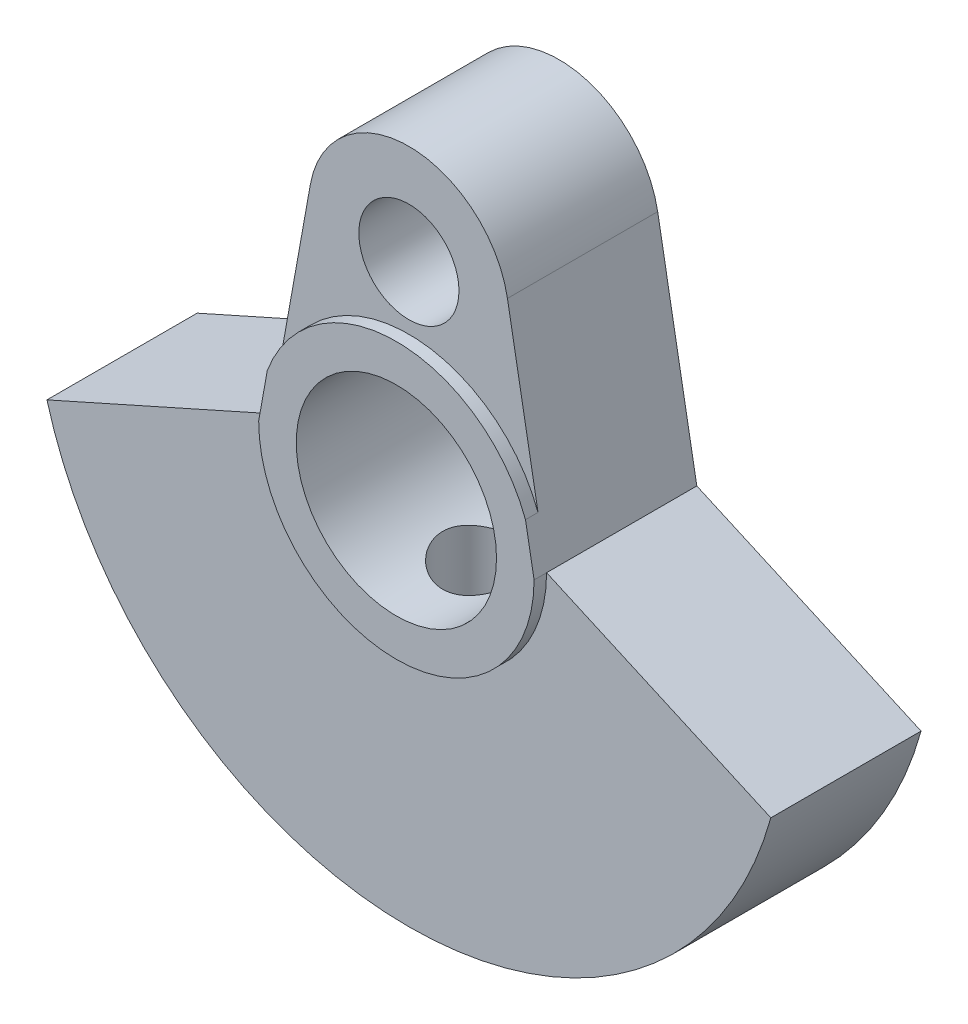
ISO-10303-21;
HEADER;
FILE_DESCRIPTION(('STEP AP214'),'2;1');
FILE_NAME('part.step','',(''),(''),'','','');
FILE_SCHEMA(('AUTOMOTIVE_DESIGN { 1 0 10303 214 1 1 1 1 }'));
ENDSEC;
DATA;
#1=APPLICATION_CONTEXT('core data for automotive mechanical design processes');
#2=APPLICATION_PROTOCOL_DEFINITION('international standard','automotive_design',2000,#1);
#3=PRODUCT_CONTEXT('',#1,'mechanical');
#4=PRODUCT('Part','Part','',(#3));
#5=PRODUCT_RELATED_PRODUCT_CATEGORY('part','',(#4));
#6=PRODUCT_DEFINITION_FORMATION('','',#4);
#7=PRODUCT_DEFINITION_CONTEXT('part definition',#1,'design');
#8=PRODUCT_DEFINITION('design','',#6,#7);
#9=PRODUCT_DEFINITION_SHAPE('','',#8);
#10=(LENGTH_UNIT() NAMED_UNIT(*) SI_UNIT(.MILLI.,.METRE.));
#11=(NAMED_UNIT(*) PLANE_ANGLE_UNIT() SI_UNIT($,.RADIAN.));
#12=(NAMED_UNIT(*) SI_UNIT($,.STERADIAN.) SOLID_ANGLE_UNIT());
#13=UNCERTAINTY_MEASURE_WITH_UNIT(LENGTH_MEASURE(1.E-05),#10,'distance_accuracy_value','');
#14=(GEOMETRIC_REPRESENTATION_CONTEXT(3) GLOBAL_UNCERTAINTY_ASSIGNED_CONTEXT((#13)) GLOBAL_UNIT_ASSIGNED_CONTEXT((#10,
#11,#12)) REPRESENTATION_CONTEXT('',''));
#15=CARTESIAN_POINT('',(0.,0.,0.));
#16=DIRECTION('',(0.,0.,1.));
#17=DIRECTION('',(1.,0.,0.));
#18=AXIS2_PLACEMENT_3D('',#15,#16,#17);
#19=CARTESIAN_POINT('',(0.,0.,6.));
#20=DIRECTION('',(0.,0.,1.));
#21=DIRECTION('',(1.,0.,0.));
#22=AXIS2_PLACEMENT_3D('',#19,#20,#21);
#23=PLANE('',#22);
#24=CARTESIAN_POINT('',(0.,0.,6.));
#25=DIRECTION('',(0.,0.,1.));
#26=DIRECTION('',(1.,0.,0.));
#27=AXIS2_PLACEMENT_3D('',#24,#25,#26);
#28=CIRCLE('',#27,5.5);
#29=CARTESIAN_POINT('',(-5.5,0.,6.));
#30=VERTEX_POINT('',#29);
#31=CARTESIAN_POINT('',(5.5,0.,6.));
#32=VERTEX_POINT('',#31);
#33=EDGE_CURVE('E75',#30,#32,#28,.T.);
#34=ORIENTED_EDGE('',*,*,#33,.F.);
#35=DIRECTION('',(-0.9130842111692,-0.407771042759929,0.));
#36=VECTOR('',#35,1.);
#37=CARTESIAN_POINT('',(-5.5,0.,6.));
#38=LINE('',#37,#36);
#39=CARTESIAN_POINT('',(-14.456832294801,-4.,6.));
#40=VERTEX_POINT('',#39);
#41=EDGE_CURVE('E161',#30,#40,#38,.T.);
#42=ORIENTED_EDGE('',*,*,#41,.T.);
#43=CARTESIAN_POINT('',(0.,0.,6.));
#44=DIRECTION('',(0.,0.,1.));
#45=DIRECTION('',(1.,0.,0.));
#46=AXIS2_PLACEMENT_3D('',#43,#44,#45);
#47=CIRCLE('',#46,15.);
#48=CARTESIAN_POINT('',(14.456832294801,-4.,6.));
#49=VERTEX_POINT('',#48);
#50=EDGE_CURVE('E111',#40,#49,#47,.T.);
#51=ORIENTED_EDGE('',*,*,#50,.T.);
#52=DIRECTION('',(-0.9130842111692,0.407771042759929,0.));
#53=VECTOR('',#52,1.);
#54=CARTESIAN_POINT('',(5.5,0.,6.));
#55=LINE('',#54,#53);
#56=EDGE_CURVE('E128',#49,#32,#55,.T.);
#57=ORIENTED_EDGE('',*,*,#56,.T.);
#58=EDGE_LOOP('',(#34,#42,#51,#57));
#59=FACE_BOUND('',#58,.T.);
#60=ADVANCED_FACE('F45',(#59),#23,.T.);
#61=CARTESIAN_POINT('',(0.,0.,6.));
#62=DIRECTION('',(0.,0.,1.));
#63=DIRECTION('',(1.,0.,0.));
#64=AXIS2_PLACEMENT_3D('',#61,#62,#63);
#65=CIRCLE('',#64,5.5);
#66=CARTESIAN_POINT('',(5.15661042473575,1.91294770642237,6.));
#67=VERTEX_POINT('',#66);
#68=CARTESIAN_POINT('',(-5.15661042473575,1.91294770642237,6.));
#69=VERTEX_POINT('',#68);
#70=EDGE_CURVE('E66',#67,#69,#65,.T.);
#71=ORIENTED_EDGE('',*,*,#70,.F.);
#72=DIRECTION('',(-0.176683995072932,0.984267629196992,0.));
#73=VECTOR('',#72,1.);
#74=CARTESIAN_POINT('',(5.5,0.,6.));
#75=LINE('',#74,#73);
#76=CARTESIAN_POINT('',(3.93707051678797,8.70673598029173,6.));
#77=VERTEX_POINT('',#76);
#78=EDGE_CURVE('E118',#67,#77,#75,.T.);
#79=ORIENTED_EDGE('',*,*,#78,.T.);
#80=CARTESIAN_POINT('',(0.,8.,6.));
#81=DIRECTION('',(0.,0.,1.));
#82=DIRECTION('',(1.,0.,0.));
#83=AXIS2_PLACEMENT_3D('',#80,#81,#82);
#84=CIRCLE('',#83,4.);
#85=CARTESIAN_POINT('',(-3.93707051678797,8.70673598029173,6.));
#86=VERTEX_POINT('',#85);
#87=EDGE_CURVE('E123',#77,#86,#84,.T.);
#88=ORIENTED_EDGE('',*,*,#87,.T.);
#89=DIRECTION('',(-0.176683995072932,-0.984267629196992,0.));
#90=VECTOR('',#89,1.);
#91=CARTESIAN_POINT('',(-5.5,0.,6.));
#92=LINE('',#91,#90);
#93=EDGE_CURVE('E143',#86,#69,#92,.T.);
#94=ORIENTED_EDGE('',*,*,#93,.T.);
#95=EDGE_LOOP('',(#71,#79,#88,#94));
#96=FACE_BOUND('',#95,.T.);
#97=CARTESIAN_POINT('',(0.,8.,6.));
#98=DIRECTION('',(0.,0.,1.));
#99=DIRECTION('',(1.,0.,0.));
#100=AXIS2_PLACEMENT_3D('',#97,#98,#99);
#101=CIRCLE('',#100,2.);
#102=CARTESIAN_POINT('',(2.,8.,6.));
#103=VERTEX_POINT('',#102);
#104=EDGE_CURVE('E205',#103,#103,#101,.T.);
#105=ORIENTED_EDGE('',*,*,#104,.F.);
#106=EDGE_LOOP('',(#105));
#107=FACE_BOUND('',#106,.T.);
#108=ADVANCED_FACE('F120',(#96,#107),#23,.T.);
#109=CARTESIAN_POINT('',(0.,0.,0.));
#110=DIRECTION('',(0.,0.,1.));
#111=DIRECTION('',(1.,0.,0.));
#112=AXIS2_PLACEMENT_3D('',#109,#110,#111);
#113=PLANE('',#112);
#114=DIRECTION('',(-0.9130842111692,-0.407771042759929,0.));
#115=VECTOR('',#114,1.);
#116=CARTESIAN_POINT('',(-5.5,0.,0.));
#117=LINE('',#116,#115);
#118=CARTESIAN_POINT('',(-5.5,0.,0.));
#119=VERTEX_POINT('',#118);
#120=CARTESIAN_POINT('',(-14.456832294801,-4.,0.));
#121=VERTEX_POINT('',#120);
#122=EDGE_CURVE('E149',#119,#121,#117,.T.);
#123=ORIENTED_EDGE('',*,*,#122,.F.);
#124=DIRECTION('',(-0.176683995072932,-0.984267629196992,0.));
#125=VECTOR('',#124,1.);
#126=CARTESIAN_POINT('',(-5.5,0.,0.));
#127=LINE('',#126,#125);
#128=CARTESIAN_POINT('',(-3.93707051678797,8.70673598029173,0.));
#129=VERTEX_POINT('',#128);
#130=EDGE_CURVE('E103',#129,#119,#127,.T.);
#131=ORIENTED_EDGE('',*,*,#130,.F.);
#132=CARTESIAN_POINT('',(0.,8.,0.));
#133=DIRECTION('',(0.,0.,1.));
#134=DIRECTION('',(1.,0.,0.));
#135=AXIS2_PLACEMENT_3D('',#132,#133,#134);
#136=CIRCLE('',#135,4.);
#137=CARTESIAN_POINT('',(3.93707051678797,8.70673598029173,0.));
#138=VERTEX_POINT('',#137);
#139=EDGE_CURVE('E158',#138,#129,#136,.T.);
#140=ORIENTED_EDGE('',*,*,#139,.F.);
#141=DIRECTION('',(-0.176683995072932,0.984267629196992,0.));
#142=VECTOR('',#141,1.);
#143=CARTESIAN_POINT('',(5.5,0.,0.));
#144=LINE('',#143,#142);
#145=CARTESIAN_POINT('',(5.5,0.,0.));
#146=VERTEX_POINT('',#145);
#147=EDGE_CURVE('E135',#146,#138,#144,.T.);
#148=ORIENTED_EDGE('',*,*,#147,.F.);
#149=DIRECTION('',(-0.9130842111692,0.407771042759929,0.));
#150=VECTOR('',#149,1.);
#151=CARTESIAN_POINT('',(5.5,0.,0.));
#152=LINE('',#151,#150);
#153=CARTESIAN_POINT('',(14.456832294801,-4.,0.));
#154=VERTEX_POINT('',#153);
#155=EDGE_CURVE('E155',#154,#146,#152,.T.);
#156=ORIENTED_EDGE('',*,*,#155,.F.);
#157=CARTESIAN_POINT('',(0.,0.,0.));
#158=DIRECTION('',(0.,0.,1.));
#159=DIRECTION('',(1.,0.,0.));
#160=AXIS2_PLACEMENT_3D('',#157,#158,#159);
#161=CIRCLE('',#160,15.);
#162=EDGE_CURVE('E152',#121,#154,#161,.T.);
#163=ORIENTED_EDGE('',*,*,#162,.F.);
#164=EDGE_LOOP('',(#123,#131,#140,#148,#156,#163));
#165=FACE_BOUND('',#164,.T.);
#166=CARTESIAN_POINT('',(0.,0.,0.));
#167=DIRECTION('',(0.,0.,1.));
#168=DIRECTION('',(1.,0.,0.));
#169=AXIS2_PLACEMENT_3D('',#166,#167,#168);
#170=CIRCLE('',#169,4.);
#171=CARTESIAN_POINT('',(4.,0.,0.));
#172=VERTEX_POINT('',#171);
#173=EDGE_CURVE('E153',#172,#172,#170,.T.);
#174=ORIENTED_EDGE('',*,*,#173,.T.);
#175=EDGE_LOOP('',(#174));
#176=FACE_BOUND('',#175,.T.);
#177=CARTESIAN_POINT('',(0.,8.,0.));
#178=DIRECTION('',(0.,0.,1.));
#179=DIRECTION('',(1.,0.,0.));
#180=AXIS2_PLACEMENT_3D('',#177,#178,#179);
#181=CIRCLE('',#180,2.);
#182=CARTESIAN_POINT('',(2.,8.,0.));
#183=VERTEX_POINT('',#182);
#184=EDGE_CURVE('E204',#183,#183,#181,.T.);
#185=ORIENTED_EDGE('',*,*,#184,.T.);
#186=EDGE_LOOP('',(#185));
#187=FACE_BOUND('',#186,.T.);
#188=ADVANCED_FACE('F173',(#165,#176,#187),#113,.F.);
#189=CARTESIAN_POINT('',(-5.5,0.,6.));
#190=DIRECTION('',(0.407771042759929,-0.9130842111692,0.));
#191=DIRECTION('',(0.9130842111692,0.407771042759929,0.));
#192=AXIS2_PLACEMENT_3D('',#189,#190,#191);
#193=PLANE('',#192);
#194=ORIENTED_EDGE('',*,*,#122,.T.);
#195=DIRECTION('',(0.,0.,-1.));
#196=VECTOR('',#195,1.);
#197=CARTESIAN_POINT('',(-14.456832294801,-4.,6.));
#198=LINE('',#197,#196);
#199=EDGE_CURVE('E11',#40,#121,#198,.T.);
#200=ORIENTED_EDGE('',*,*,#199,.F.);
#201=ORIENTED_EDGE('',*,*,#41,.F.);
#202=DIRECTION('',(0.,0.,-1.));
#203=VECTOR('',#202,1.);
#204=CARTESIAN_POINT('',(-5.5,0.,6.));
#205=LINE('',#204,#203);
#206=EDGE_CURVE('E145',#30,#119,#205,.T.);
#207=ORIENTED_EDGE('',*,*,#206,.T.);
#208=EDGE_LOOP('',(#194,#200,#201,#207));
#209=FACE_BOUND('',#208,.T.);
#210=ADVANCED_FACE('F47',(#209),#193,.F.);
#211=CARTESIAN_POINT('',(0.,0.,6.));
#212=DIRECTION('',(0.,0.,-1.));
#213=DIRECTION('',(-1.,0.,0.));
#214=AXIS2_PLACEMENT_3D('',#211,#212,#213);
#215=CYLINDRICAL_SURFACE('',#214,15.);
#216=ORIENTED_EDGE('',*,*,#162,.T.);
#217=DIRECTION('',(0.,0.,-1.));
#218=VECTOR('',#217,1.);
#219=CARTESIAN_POINT('',(14.456832294801,-4.,6.));
#220=LINE('',#219,#218);
#221=EDGE_CURVE('E59',#49,#154,#220,.T.);
#222=ORIENTED_EDGE('',*,*,#221,.F.);
#223=ORIENTED_EDGE('',*,*,#50,.F.);
#224=ORIENTED_EDGE('',*,*,#199,.T.);
#225=EDGE_LOOP('',(#216,#222,#223,#224));
#226=FACE_BOUND('',#225,.T.);
#227=CARTESIAN_POINT('',(0.,-15.,1.35000000000001));
#228=CARTESIAN_POINT('',(0.092381821858174,-14.9999988431375,1.35000397407824));
#229=CARTESIAN_POINT('',(0.184823472950828,-14.9991375118722,1.35778468265796));
#230=CARTESIAN_POINT('',(0.367140384637059,-14.9957843241747,1.38870399434833));
#231=CARTESIAN_POINT('',(0.457012763410699,-14.9932907064293,1.41185918763367));
#232=CARTESIAN_POINT('',(0.631524868732983,-14.9869542195955,1.47284213795446));
#233=CARTESIAN_POINT('',(0.716167852564643,-14.9831122005694,1.51066065247303));
#234=CARTESIAN_POINT('',(0.877887506534778,-14.9745076566348,1.59987789047907));
#235=CARTESIAN_POINT('',(0.954965599904042,-14.9697453053767,1.65127405277463));
#236=CARTESIAN_POINT('',(1.09971749291982,-14.9598099458213,1.76642513016235));
#237=CARTESIAN_POINT('',(1.16735402776654,-14.9546354302355,1.83022676384704));
#238=CARTESIAN_POINT('',(1.29098229654243,-14.9444712876292,1.96827771795949));
#239=CARTESIAN_POINT('',(1.34697347210661,-14.9394816694836,2.04252753906488));
#240=CARTESIAN_POINT('',(1.44585644392366,-14.9302371294103,2.1996041169707));
#241=CARTESIAN_POINT('',(1.4887140314528,-14.9259841384625,2.28245253227903));
#242=CARTESIAN_POINT('',(1.55989482430127,-14.9187136159984,2.45422484675052));
#243=CARTESIAN_POINT('',(1.5882184598808,-14.9156960479094,2.54314856597328));
#244=CARTESIAN_POINT('',(1.6294157216232,-14.9112520065666,2.72416431324198));
#245=CARTESIAN_POINT('',(1.6423516348485,-14.9098191204392,2.81624200529499));
#246=CARTESIAN_POINT('',(1.65259886462404,-14.908686898868,3.00127181424992));
#247=CARTESIAN_POINT('',(1.64991067288424,-14.908987508869,3.09422390354157));
#248=CARTESIAN_POINT('',(1.62903725829947,-14.9112824512349,3.27793281906692));
#249=CARTESIAN_POINT('',(1.61092026760877,-14.9132693261476,3.36869750429989));
#250=CARTESIAN_POINT('',(1.55980980676325,-14.9187012894236,3.54589026922768));
#251=CARTESIAN_POINT('',(1.52681609784369,-14.9221464011908,3.63231827929605));
#252=CARTESIAN_POINT('',(1.44681419634299,-14.9301152023445,3.79859852959656));
#253=CARTESIAN_POINT('',(1.39977596429643,-14.9346411994129,3.8784362019399));
#254=CARTESIAN_POINT('',(1.29304180674751,-14.944259925937,4.02910998413143));
#255=CARTESIAN_POINT('',(1.23334543269005,-14.9493526754732,4.0999457748458));
#256=CARTESIAN_POINT('',(1.10260955971916,-14.9595642939927,4.23100135292739));
#257=CARTESIAN_POINT('',(1.03151117609732,-14.9646831571922,4.291162415296));
#258=CARTESIAN_POINT('',(0.880193329427116,-14.9743446474524,4.39870484603086));
#259=CARTESIAN_POINT('',(0.799973852605642,-14.978887273643,4.446086195099));
#260=CARTESIAN_POINT('',(0.632648549173298,-14.9868864198642,4.52672275506591));
#261=CARTESIAN_POINT('',(0.54554114854153,-14.9903426907391,4.55997472600502));
#262=CARTESIAN_POINT('',(0.366932993265996,-14.9957772807096,4.61136425628381));
#263=CARTESIAN_POINT('',(0.275432397824437,-14.9977556533188,4.62950236288868));
#264=CARTESIAN_POINT('',(0.0911434787578456,-15.0000046359516,4.65007418859381));
#265=CARTESIAN_POINT('',(-0.00163570174845526,-15.0002840523084,4.65258889119218));
#266=CARTESIAN_POINT('',(-0.186294166416551,-14.9991273146614,4.64205560627015));
#267=CARTESIAN_POINT('',(-0.278173465315142,-14.9976911887995,4.62900787403706));
#268=CARTESIAN_POINT('',(-0.458188360559868,-14.9932703044021,4.58778731886136));
#269=CARTESIAN_POINT('',(-0.546332803398981,-14.9902894555646,4.5596526747105));
#270=CARTESIAN_POINT('',(-0.716651536032791,-14.9831132635213,4.48909634060411));
#271=CARTESIAN_POINT('',(-0.798825665625385,-14.9789178877409,4.44667426744436));
#272=CARTESIAN_POINT('',(-0.955235638443855,-14.9697593637147,4.34854827826069));
#273=CARTESIAN_POINT('',(-1.02943811324487,-14.9647931858517,4.2927914613703));
#274=CARTESIAN_POINT('',(-1.1674600255377,-14.9546593253991,4.16965418632295));
#275=CARTESIAN_POINT('',(-1.23127914630014,-14.9494916366686,4.10227337372175));
#276=CARTESIAN_POINT('',(-1.34700625191035,-14.9395104302445,3.95744616179261));
#277=CARTESIAN_POINT('',(-1.39886088486303,-14.9346985615749,3.87995700069063));
#278=CARTESIAN_POINT('',(-1.48881961499013,-14.9259997112416,3.71732235207821));
#279=CARTESIAN_POINT('',(-1.52692393381705,-14.9221127146694,3.63217698801197));
#280=CARTESIAN_POINT('',(-1.58821216984629,-14.9157144017887,3.45682581030272));
#281=CARTESIAN_POINT('',(-1.61142720744415,-14.913200217783,3.36663098279506));
#282=CARTESIAN_POINT('',(-1.64237859902929,-14.9098235690547,3.18359422001475));
#283=CARTESIAN_POINT('',(-1.65011549909774,-14.9089610460603,3.09075237824812));
#284=CARTESIAN_POINT('',(-1.64988250778875,-14.9089867901201,2.9055874603336));
#285=CARTESIAN_POINT('',(-1.64199642382742,-14.9098657154103,2.81326426608027));
#286=CARTESIAN_POINT('',(-1.61091769726742,-14.9132553441701,2.63126321364289));
#287=CARTESIAN_POINT('',(-1.58772504262742,-14.9157660489234,2.54158535753993));
#288=CARTESIAN_POINT('',(-1.52671583943656,-14.9221336424926,2.36742518682386));
#289=CARTESIAN_POINT('',(-1.48890235332836,-14.9259902493827,2.28294178848482));
#290=CARTESIAN_POINT('',(-1.39973329169087,-14.9346156407071,2.1215068615654));
#291=CARTESIAN_POINT('',(-1.3483776993887,-14.9393844262711,2.04455534231397));
#292=CARTESIAN_POINT('',(-1.23326864168925,-14.9493275259266,1.8999392703203));
#293=CARTESIAN_POINT('',(-1.16945266430596,-14.9545038027611,1.83232460764933));
#294=CARTESIAN_POINT('',(-1.03136150958025,-14.9646609076263,1.70872907899544));
#295=CARTESIAN_POINT('',(-0.957083846303531,-14.969641688842,1.65275098597639));
#296=CARTESIAN_POINT('',(-0.799929681435435,-14.9788625057048,1.55388123329122));
#297=CARTESIAN_POINT('',(-0.717028162742394,-14.9831002847694,1.51102915416637));
#298=CARTESIAN_POINT('',(-0.545209885523749,-14.9903338724846,1.43991277149217));
#299=CARTESIAN_POINT('',(-0.456299942937419,-14.993331061833,1.41163224210026));
#300=CARTESIAN_POINT('',(-0.305751892942927,-14.9970040251543,1.37740874233584));
#301=CARTESIAN_POINT('',(-0.245071615108731,-14.9981221898992,1.3671447762129));
#302=CARTESIAN_POINT('',(-0.122936388450104,-14.9996205603388,1.35343910055461));
#303=CARTESIAN_POINT('',(-0.0614814436954418,-15.0000007699088,1.34999735519324));
#304=CARTESIAN_POINT('',(0.,-15.,1.35000000000001));
#305=B_SPLINE_CURVE_WITH_KNOTS('',3,(#227,#228,#229,#230,#231,#232,#233,#234,#235,#236,#237,
#238,#239,#240,#241,#242,#243,#244,#245,#246,#247,#248,#249,#250,#251,#252,#253,#254,#255,#256,
#257,#258,#259,#260,#261,#262,#263,#264,#265,#266,#267,#268,#269,#270,#271,#272,#273,#274,#275,
#276,#277,#278,#279,#280,#281,#282,#283,#284,#285,#286,#287,#288,#289,#290,#291,#292,#293,#294,
#295,#296,#297,#298,#299,#300,#301,#302,#303,#304),.UNSPECIFIED.,.T.,.F.,(4,2,2,2,2,2,2,2,2,2,2,
2,2,2,2,2,2,2,2,2,2,2,2,2,2,2,2,2,2,2,2,2,2,2,2,2,2,2,4),(0.,0.276920934615253,
0.554141173519897,0.831186959564194,1.10818052291128,1.38623817794143,1.66430916204826,
1.94309839229292,2.22187936884105,2.49952800190879,2.77716789707698,3.05358629881208,
3.33000913709781,3.6070274967635,3.88405567451858,4.16256356312761,4.44107187229717,
4.71964401084107,4.99820606199366,5.27532298117501,5.55243535457278,5.82884975677336,
6.1052715732962,6.38280873719028,6.6603543653718,6.93911468163527,7.21787050413383,
7.49604177805966,7.77420323770545,8.05087657749378,8.3275501349349,8.60416577239306,
8.88078175246168,9.15882288790668,9.4369302040601,9.71586805930808,9.99449463424154,
10.1787905045231,10.3630854069961),.UNSPECIFIED.);
#306=CARTESIAN_POINT('',(0.,-15.,1.35000000000001));
#307=VERTEX_POINT('',#306);
#308=EDGE_CURVE('E49',#307,#307,#305,.T.);
#309=ORIENTED_EDGE('',*,*,#308,.F.);
#310=EDGE_LOOP('',(#309));
#311=FACE_BOUND('',#310,.T.);
#312=ADVANCED_FACE('F275',(#226,#311),#215,.T.);
#313=CARTESIAN_POINT('',(5.5,0.,6.));
#314=DIRECTION('',(-0.407771042759929,-0.9130842111692,0.));
#315=DIRECTION('',(0.9130842111692,-0.407771042759929,0.));
#316=AXIS2_PLACEMENT_3D('',#313,#314,#315);
#317=PLANE('',#316);
#318=ORIENTED_EDGE('',*,*,#155,.T.);
#319=DIRECTION('',(0.,0.,-1.));
#320=VECTOR('',#319,1.);
#321=CARTESIAN_POINT('',(5.5,0.,6.));
#322=LINE('',#321,#320);
#323=EDGE_CURVE('E138',#32,#146,#322,.T.);
#324=ORIENTED_EDGE('',*,*,#323,.F.);
#325=ORIENTED_EDGE('',*,*,#56,.F.);
#326=ORIENTED_EDGE('',*,*,#221,.T.);
#327=EDGE_LOOP('',(#318,#324,#325,#326));
#328=FACE_BOUND('',#327,.T.);
#329=ADVANCED_FACE('F169',(#328),#317,.F.);
#330=CARTESIAN_POINT('',(5.5,0.,6.));
#331=DIRECTION('',(-0.984267629196992,-0.176683995072932,0.));
#332=DIRECTION('',(0.176683995072932,-0.984267629196992,0.));
#333=AXIS2_PLACEMENT_3D('',#330,#331,#332);
#334=PLANE('',#333);
#335=ORIENTED_EDGE('',*,*,#147,.T.);
#336=DIRECTION('',(0.,0.,-1.));
#337=VECTOR('',#336,1.);
#338=CARTESIAN_POINT('',(3.93707051678797,8.70673598029173,6.));
#339=LINE('',#338,#337);
#340=EDGE_CURVE('E131',#77,#138,#339,.T.);
#341=ORIENTED_EDGE('',*,*,#340,.F.);
#342=ORIENTED_EDGE('',*,*,#78,.F.);
#343=DIRECTION('',(0.,0.,-1.));
#344=VECTOR('',#343,1.);
#345=CARTESIAN_POINT('',(5.15661042473575,1.91294770642237,6.5));
#346=LINE('',#345,#344);
#347=CARTESIAN_POINT('',(5.15661042473575,1.91294770642237,6.5));
#348=VERTEX_POINT('',#347);
#349=EDGE_CURVE('E185',#348,#67,#346,.T.);
#350=ORIENTED_EDGE('',*,*,#349,.F.);
#351=DIRECTION('',(-0.176683995072932,0.984267629196992,0.));
#352=VECTOR('',#351,1.);
#353=CARTESIAN_POINT('',(5.15661042473575,1.91294770642237,6.5));
#354=LINE('',#353,#352);
#355=CARTESIAN_POINT('',(5.5,0.,6.5));
#356=VERTEX_POINT('',#355);
#357=EDGE_CURVE('E189',#356,#348,#354,.T.);
#358=ORIENTED_EDGE('',*,*,#357,.F.);
#359=DIRECTION('',(0.,0.,-1.));
#360=VECTOR('',#359,1.);
#361=CARTESIAN_POINT('',(5.5,0.,6.5));
#362=LINE('',#361,#360);
#363=EDGE_CURVE('E201',#356,#32,#362,.T.);
#364=ORIENTED_EDGE('',*,*,#363,.T.);
#365=ORIENTED_EDGE('',*,*,#323,.T.);
#366=EDGE_LOOP('',(#335,#341,#342,#350,#358,#364,#365));
#367=FACE_BOUND('',#366,.T.);
#368=ADVANCED_FACE('F132',(#367),#334,.F.);
#369=CARTESIAN_POINT('',(0.,8.,6.));
#370=DIRECTION('',(0.,0.,-1.));
#371=DIRECTION('',(-1.,0.,0.));
#372=AXIS2_PLACEMENT_3D('',#369,#370,#371);
#373=CYLINDRICAL_SURFACE('',#372,4.);
#374=ORIENTED_EDGE('',*,*,#139,.T.);
#375=DIRECTION('',(0.,0.,-1.));
#376=VECTOR('',#375,1.);
#377=CARTESIAN_POINT('',(-3.93707051678797,8.70673598029173,6.));
#378=LINE('',#377,#376);
#379=EDGE_CURVE('E139',#86,#129,#378,.T.);
#380=ORIENTED_EDGE('',*,*,#379,.F.);
#381=ORIENTED_EDGE('',*,*,#87,.F.);
#382=ORIENTED_EDGE('',*,*,#340,.T.);
#383=EDGE_LOOP('',(#374,#380,#381,#382));
#384=FACE_BOUND('',#383,.T.);
#385=ADVANCED_FACE('F141',(#384),#373,.T.);
#386=CARTESIAN_POINT('',(-5.5,0.,6.));
#387=DIRECTION('',(0.984267629196992,-0.176683995072932,0.));
#388=DIRECTION('',(0.176683995072932,0.984267629196992,0.));
#389=AXIS2_PLACEMENT_3D('',#386,#387,#388);
#390=PLANE('',#389);
#391=ORIENTED_EDGE('',*,*,#130,.T.);
#392=ORIENTED_EDGE('',*,*,#206,.F.);
#393=DIRECTION('',(0.,0.,-1.));
#394=VECTOR('',#393,1.);
#395=CARTESIAN_POINT('',(-5.5,0.,6.5));
#396=LINE('',#395,#394);
#397=CARTESIAN_POINT('',(-5.5,0.,6.5));
#398=VERTEX_POINT('',#397);
#399=EDGE_CURVE('E195',#398,#30,#396,.T.);
#400=ORIENTED_EDGE('',*,*,#399,.F.);
#401=DIRECTION('',(-0.176683995072932,-0.984267629196992,0.));
#402=VECTOR('',#401,1.);
#403=CARTESIAN_POINT('',(-5.15661042473575,1.91294770642237,6.5));
#404=LINE('',#403,#402);
#405=CARTESIAN_POINT('',(-5.15661042473575,1.91294770642237,6.5));
#406=VERTEX_POINT('',#405);
#407=EDGE_CURVE('E198',#406,#398,#404,.T.);
#408=ORIENTED_EDGE('',*,*,#407,.F.);
#409=DIRECTION('',(0.,0.,-1.));
#410=VECTOR('',#409,1.);
#411=CARTESIAN_POINT('',(-5.15661042473575,1.91294770642237,6.5));
#412=LINE('',#411,#410);
#413=EDGE_CURVE('E179',#406,#69,#412,.T.);
#414=ORIENTED_EDGE('',*,*,#413,.T.);
#415=ORIENTED_EDGE('',*,*,#93,.F.);
#416=ORIENTED_EDGE('',*,*,#379,.T.);
#417=EDGE_LOOP('',(#391,#392,#400,#408,#414,#415,#416));
#418=FACE_BOUND('',#417,.T.);
#419=ADVANCED_FACE('F175',(#418),#390,.F.);
#420=CARTESIAN_POINT('',(0.,0.,6.));
#421=DIRECTION('',(0.,0.,-1.));
#422=DIRECTION('',(-1.,0.,0.));
#423=AXIS2_PLACEMENT_3D('',#420,#421,#422);
#424=CYLINDRICAL_SURFACE('',#423,4.);
#425=CARTESIAN_POINT('',(0.,-4.,1.35000000000001));
#426=CARTESIAN_POINT('',(-0.0884596783632785,-3.99999309817074,1.35000921720664));
#427=CARTESIAN_POINT('',(-0.177062252057582,-3.99703145792172,1.35715601434332));
#428=CARTESIAN_POINT('',(-0.351759669836408,-3.9854711320255,1.3854911419369));
#429=CARTESIAN_POINT('',(-0.437847271996959,-3.97685757767606,1.40671651102432));
#430=CARTESIAN_POINT('',(-0.604702496902739,-3.95491965529936,1.4622948122019));
#431=CARTESIAN_POINT('',(-0.685486934491194,-3.94161112398211,1.49660364335346));
#432=CARTESIAN_POINT('',(-0.840076633223485,-3.91158286286531,1.57719475784943));
#433=CARTESIAN_POINT('',(-0.913884076117563,-3.89486420463244,1.62347328117016));
#434=CARTESIAN_POINT('',(-1.05618769598525,-3.85876900012149,1.72910675464405));
#435=CARTESIAN_POINT('',(-1.12429373957476,-3.83930654387258,1.78895767024898));
#436=CARTESIAN_POINT('',(-1.24983574384757,-3.80029483347099,1.91898883965897));
#437=CARTESIAN_POINT('',(-1.30726618926957,-3.78074553976622,1.98917439921181));
#438=CARTESIAN_POINT('',(-1.41254826809049,-3.74272551686067,2.14196824887172));
#439=CARTESIAN_POINT('',(-1.45980781790561,-3.72435159658093,2.22501111530653));
#440=CARTESIAN_POINT('',(-1.53951358199406,-3.69212136090386,2.39873630929018));
#441=CARTESIAN_POINT('',(-1.5719672771279,-3.67826276509115,2.48941475136301));
#442=CARTESIAN_POINT('',(-1.61953738222491,-3.65756021871623,2.67134799700183));
#443=CARTESIAN_POINT('',(-1.63540371417153,-3.65041449103237,2.76237107214307));
#444=CARTESIAN_POINT('',(-1.65168918120802,-3.64307714795703,2.94604650736528));
#445=CARTESIAN_POINT('',(-1.65211659474,-3.64288180572738,3.0386979676293));
#446=CARTESIAN_POINT('',(-1.6380778077983,-3.64921138579605,3.21559888661872));
#447=CARTESIAN_POINT('',(-1.62472398487458,-3.6552343974104,3.29995815874916));
#448=CARTESIAN_POINT('',(-1.58536484231197,-3.67247532251837,3.46511028438117));
#449=CARTESIAN_POINT('',(-1.55935715587184,-3.68369420783859,3.5459024676033));
#450=CARTESIAN_POINT('',(-1.49492412942488,-3.71031458481431,3.70364510875862));
#451=CARTESIAN_POINT('',(-1.45624866973016,-3.72579923184191,3.78047873780833));
#452=CARTESIAN_POINT('',(-1.36775445443624,-3.75918616236907,3.92686023246003));
#453=CARTESIAN_POINT('',(-1.31793135478158,-3.77708938726885,3.99640524224915));
#454=CARTESIAN_POINT('',(-1.20371911924868,-3.81509742396095,4.13228640778781));
#455=CARTESIAN_POINT('',(-1.13846630094388,-3.8352618825369,4.19788195770325));
#456=CARTESIAN_POINT('',(-0.997682554866211,-3.87426910607353,4.31744467444137));
#457=CARTESIAN_POINT('',(-0.922149319847429,-3.8931115728953,4.37140922386084));
#458=CARTESIAN_POINT('',(-0.760736369737321,-3.92787932271737,4.46723477358503));
#459=CARTESIAN_POINT('',(-0.674664094072233,-3.94373050716791,4.50880028319417));
#460=CARTESIAN_POINT('',(-0.495928253552974,-3.97016319816605,4.57660302410887));
#461=CARTESIAN_POINT('',(-0.403268287372383,-3.98074755693754,4.60284855321116));
#462=CARTESIAN_POINT('',(-0.220181304317672,-3.99492450637935,4.63772950367822));
#463=CARTESIAN_POINT('',(-0.129974172308221,-3.99891121146315,4.64735917793593));
#464=CARTESIAN_POINT('',(0.0508474401522225,-4.00069746426785,4.65169204376329));
#465=CARTESIAN_POINT('',(0.141461799500566,-3.99849874371343,4.64639941310821));
#466=CARTESIAN_POINT('',(0.315907755487548,-3.98841747083847,4.62175473175704));
#467=CARTESIAN_POINT('',(0.399855317526685,-3.9808153168881,4.6030959266599));
#468=CARTESIAN_POINT('',(0.563340473329574,-3.96098887803091,4.55320790366289));
#469=CARTESIAN_POINT('',(0.642877505872145,-3.94876400644332,4.5219770901852));
#470=CARTESIAN_POINT('',(0.798061975964474,-3.92039728883464,4.4468106200191));
#471=CARTESIAN_POINT('',(0.873512656660505,-3.90414585630856,4.40251143824378));
#472=CARTESIAN_POINT('',(1.01617847320907,-3.86946768187548,4.30286606574213));
#473=CARTESIAN_POINT('',(1.0833901834211,-3.85104004134398,4.24751530491016));
#474=CARTESIAN_POINT('',(1.21261994292741,-3.8124029584454,4.12279569518802));
#475=CARTESIAN_POINT('',(1.27394364561822,-3.79215916493832,4.0527161759607));
#476=CARTESIAN_POINT('',(1.38414835482505,-3.75333928940831,3.90292870939147));
#477=CARTESIAN_POINT('',(1.43302674162727,-3.73476355904109,3.82321874005744));
#478=CARTESIAN_POINT('',(1.51742282291387,-3.70128700339843,3.65490462946668));
#479=CARTESIAN_POINT('',(1.55275802936534,-3.68643724424496,3.56619808399194));
#480=CARTESIAN_POINT('',(1.60769618165393,-3.66281640168181,3.38329083402175));
#481=CARTESIAN_POINT('',(1.62731175174752,-3.65404044124936,3.28909460358182));
#482=CARTESIAN_POINT('',(1.64901123940267,-3.64429559365239,3.10556972684193));
#483=CARTESIAN_POINT('',(1.65231049364124,-3.64278573581524,3.01641278054206));
#484=CARTESIAN_POINT('',(1.64451485356567,-3.64631178238903,2.83887152924082));
#485=CARTESIAN_POINT('',(1.63342206561729,-3.65134672892697,2.75048711308063));
#486=CARTESIAN_POINT('',(1.59817118006571,-3.666904904187,2.5810669287423));
#487=CARTESIAN_POINT('',(1.57461958437453,-3.67717261200251,2.49987928857789));
#488=CARTESIAN_POINT('',(1.51570599472927,-3.70184411206584,2.34258547752592));
#489=CARTESIAN_POINT('',(1.48034069596892,-3.71624906152171,2.26648073570239));
#490=CARTESIAN_POINT('',(1.3963806225379,-3.7486340889516,2.1165779617586));
#491=CARTESIAN_POINT('',(1.3471244359927,-3.76677577854003,2.04318592897859));
#492=CARTESIAN_POINT('',(1.23771718137822,-3.80412864636709,1.90532831273572));
#493=CARTESIAN_POINT('',(1.17756245772961,-3.82334018195057,1.84086573722558));
#494=CARTESIAN_POINT('',(1.04300738755743,-3.86230172013188,1.71800586129633));
#495=CARTESIAN_POINT('',(0.967900110730173,-3.88199359359226,1.66036077639447));
#496=CARTESIAN_POINT('',(0.808343463182031,-3.91832426905579,1.55845984046129));
#497=CARTESIAN_POINT('',(0.723889843442847,-3.9349616732268,1.51421011363411));
#498=CARTESIAN_POINT('',(0.549414760109625,-3.96305691394126,1.44133626016526));
#499=CARTESIAN_POINT('',(0.459513381649422,-3.97459855421812,1.41245757464146));
#500=CARTESIAN_POINT('',(0.275719229213239,-3.99154438775475,1.37048891521486));
#501=CARTESIAN_POINT('',(0.181839966818028,-3.99696786149576,1.35734933375456));
#502=CARTESIAN_POINT('',(0.0584442952271953,-3.99968194626838,1.35077322966997));
#503=CARTESIAN_POINT('',(0.0292299486703375,-4.00000228058838,1.34999695433579));
#504=CARTESIAN_POINT('',(0.,-4.,1.35000000000001));
#505=B_SPLINE_CURVE_WITH_KNOTS('',3,(#425,#426,#427,#428,#429,#430,#431,#432,#433,#434,#435,
#436,#437,#438,#439,#440,#441,#442,#443,#444,#445,#446,#447,#448,#449,#450,#451,#452,#453,#454,
#455,#456,#457,#458,#459,#460,#461,#462,#463,#464,#465,#466,#467,#468,#469,#470,#471,#472,#473,
#474,#475,#476,#477,#478,#479,#480,#481,#482,#483,#484,#485,#486,#487,#488,#489,#490,#491,#492,
#493,#494,#495,#496,#497,#498,#499,#500,#501,#502,#503,#504),.UNSPECIFIED.,.T.,.F.,(4,2,2,2,2,2,
2,2,2,2,2,2,2,2,2,2,2,2,2,2,2,2,2,2,2,2,2,2,2,2,2,2,2,2,2,2,2,2,2,4),(0.,0.265297098770619,
0.531294937906658,0.796403981498878,1.06142984766523,1.33841878994456,1.61555043582129,
1.90598404924537,2.19627075414924,2.4727764853942,2.74913395037959,3.00480633611682,
3.2605265616686,3.5216353930134,3.78284615202014,4.06565185095455,4.34852112528508,
4.63767392136374,4.92666995726766,5.19768149557684,5.46861716672804,5.72643264660552,
5.98428085748383,6.25011488704504,6.51605907418431,6.800645802504,7.08529238632156,
7.37364985225779,7.66177550895674,7.92807823226722,8.19434198489783,8.44869772098557,
8.70312467109943,8.97267479984707,9.24231550885211,9.53104085816539,9.81989801073176,
10.1038095613048,10.3868238858898,10.4744866574817),.UNSPECIFIED.);
#506=CARTESIAN_POINT('',(0.,-4.,1.35000000000001));
#507=VERTEX_POINT('',#506);
#508=EDGE_CURVE('E236',#507,#507,#505,.T.);
#509=ORIENTED_EDGE('',*,*,#508,.F.);
#510=EDGE_LOOP('',(#509));
#511=FACE_BOUND('',#510,.T.);
#512=ORIENTED_EDGE('',*,*,#173,.F.);
#513=EDGE_LOOP('',(#512));
#514=FACE_BOUND('',#513,.T.);
#515=CARTESIAN_POINT('',(0.,0.,6.5));
#516=DIRECTION('',(0.,0.,1.));
#517=DIRECTION('',(1.,0.,0.));
#518=AXIS2_PLACEMENT_3D('',#515,#516,#517);
#519=CIRCLE('',#518,4.);
#520=CARTESIAN_POINT('',(4.,0.,6.5));
#521=VERTEX_POINT('',#520);
#522=EDGE_CURVE('E191',#521,#521,#519,.T.);
#523=ORIENTED_EDGE('',*,*,#522,.T.);
#524=EDGE_LOOP('',(#523));
#525=FACE_BOUND('',#524,.T.);
#526=ADVANCED_FACE('F265',(#511,#514,#525),#424,.F.);
#527=CARTESIAN_POINT('',(0.,8.,6.));
#528=DIRECTION('',(0.,0.,-1.));
#529=DIRECTION('',(-1.,0.,0.));
#530=AXIS2_PLACEMENT_3D('',#527,#528,#529);
#531=CYLINDRICAL_SURFACE('',#530,2.);
#532=ORIENTED_EDGE('',*,*,#104,.T.);
#533=EDGE_LOOP('',(#532));
#534=FACE_BOUND('',#533,.T.);
#535=ORIENTED_EDGE('',*,*,#184,.F.);
#536=EDGE_LOOP('',(#535));
#537=FACE_BOUND('',#536,.T.);
#538=ADVANCED_FACE('F313',(#534,#537),#531,.F.);
#539=CARTESIAN_POINT('',(0.,0.,6.5));
#540=DIRECTION('',(0.,0.,1.));
#541=DIRECTION('',(1.,0.,0.));
#542=AXIS2_PLACEMENT_3D('',#539,#540,#541);
#543=PLANE('',#542);
#544=CARTESIAN_POINT('',(0.,0.,6.5));
#545=DIRECTION('',(0.,0.,1.));
#546=DIRECTION('',(1.,0.,0.));
#547=AXIS2_PLACEMENT_3D('',#544,#545,#546);
#548=CIRCLE('',#547,5.5);
#549=EDGE_CURVE('E186',#398,#356,#548,.T.);
#550=ORIENTED_EDGE('',*,*,#549,.T.);
#551=ORIENTED_EDGE('',*,*,#357,.T.);
#552=CARTESIAN_POINT('',(0.,0.,6.5));
#553=DIRECTION('',(0.,0.,1.));
#554=DIRECTION('',(1.,0.,0.));
#555=AXIS2_PLACEMENT_3D('',#552,#553,#554);
#556=CIRCLE('',#555,5.5);
#557=EDGE_CURVE('E230',#348,#406,#556,.T.);
#558=ORIENTED_EDGE('',*,*,#557,.T.);
#559=ORIENTED_EDGE('',*,*,#407,.T.);
#560=EDGE_LOOP('',(#550,#551,#558,#559));
#561=FACE_BOUND('',#560,.T.);
#562=ORIENTED_EDGE('',*,*,#522,.F.);
#563=EDGE_LOOP('',(#562));
#564=FACE_BOUND('',#563,.T.);
#565=ADVANCED_FACE('F228',(#561,#564),#543,.T.);
#566=CARTESIAN_POINT('',(0.,0.,6.5));
#567=DIRECTION('',(0.,0.,-1.));
#568=DIRECTION('',(-1.,0.,0.));
#569=AXIS2_PLACEMENT_3D('',#566,#567,#568);
#570=CYLINDRICAL_SURFACE('',#569,5.5);
#571=ORIENTED_EDGE('',*,*,#33,.T.);
#572=ORIENTED_EDGE('',*,*,#363,.F.);
#573=ORIENTED_EDGE('',*,*,#549,.F.);
#574=ORIENTED_EDGE('',*,*,#399,.T.);
#575=EDGE_LOOP('',(#571,#572,#573,#574));
#576=FACE_BOUND('',#575,.T.);
#577=ADVANCED_FACE('F218',(#576),#570,.T.);
#578=CARTESIAN_POINT('',(0.,0.,6.5));
#579=DIRECTION('',(0.,0.,-1.));
#580=DIRECTION('',(-1.,0.,0.));
#581=AXIS2_PLACEMENT_3D('',#578,#579,#580);
#582=CYLINDRICAL_SURFACE('',#581,5.5);
#583=ORIENTED_EDGE('',*,*,#70,.T.);
#584=ORIENTED_EDGE('',*,*,#413,.F.);
#585=ORIENTED_EDGE('',*,*,#557,.F.);
#586=ORIENTED_EDGE('',*,*,#349,.T.);
#587=EDGE_LOOP('',(#583,#584,#585,#586));
#588=FACE_BOUND('',#587,.T.);
#589=ADVANCED_FACE('F182',(#588),#582,.T.);
#590=CARTESIAN_POINT('',(0.,-16.5,3.));
#591=DIRECTION('',(0.,-1.,0.));
#592=DIRECTION('',(0.,0.,-1.));
#593=AXIS2_PLACEMENT_3D('',#590,#591,#592);
#594=CYLINDRICAL_SURFACE('',#593,1.64999999999999);
#595=ORIENTED_EDGE('',*,*,#308,.T.);
#596=EDGE_LOOP('',(#595));
#597=FACE_BOUND('',#596,.T.);
#598=ORIENTED_EDGE('',*,*,#508,.T.);
#599=EDGE_LOOP('',(#598));
#600=FACE_BOUND('',#599,.T.);
#601=ADVANCED_FACE('F244',(#597,#600),#594,.F.);
#602=CLOSED_SHELL('',(#60,#108,#188,#210,#312,#329,#368,#385,#419,#526,#538,#565,#577,#589,#601));
#603=MANIFOLD_SOLID_BREP('B2',#602);
#604=ADVANCED_BREP_SHAPE_REPRESENTATION('',(#18,#603),#14);
#605=SHAPE_DEFINITION_REPRESENTATION(#9,#604);
ENDSEC;
END-ISO-10303-21;
